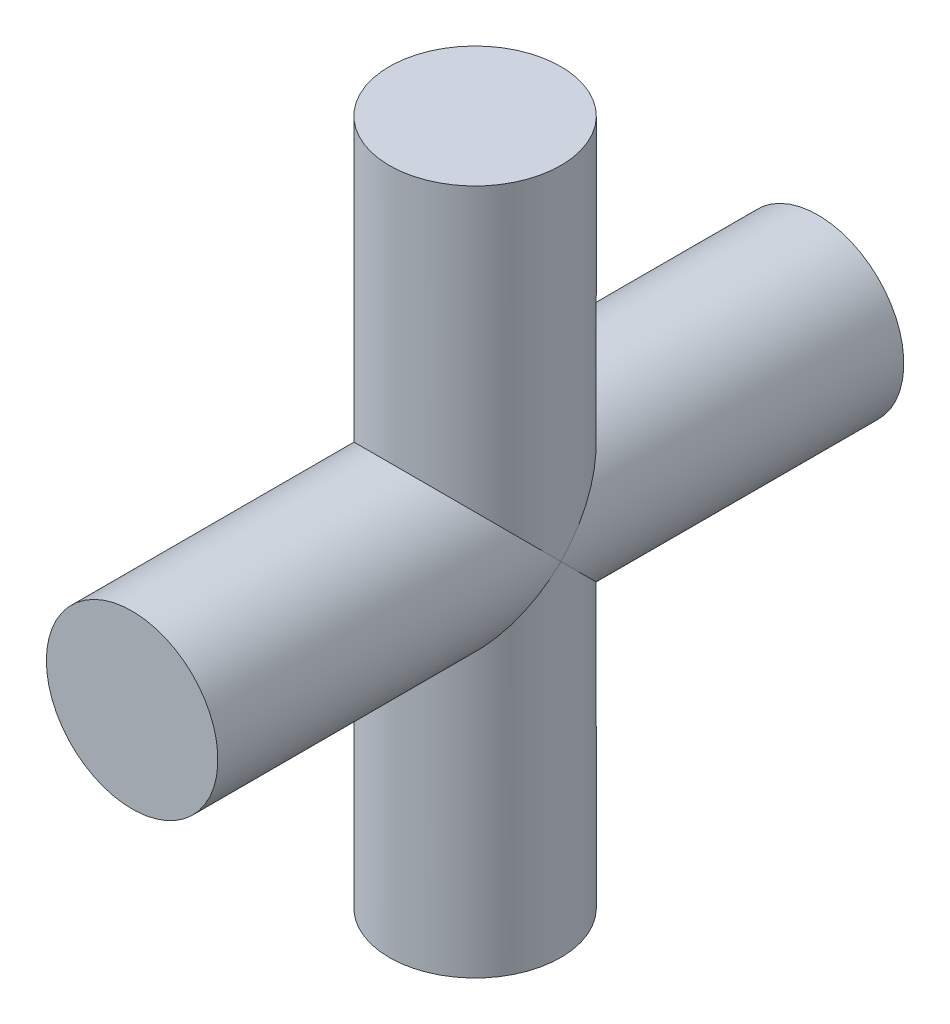
ISO-10303-21;
HEADER;
FILE_DESCRIPTION(('STEP AP214'),'2;1');
FILE_NAME('part.step','',(''),(''),'','','');
FILE_SCHEMA(('AUTOMOTIVE_DESIGN { 1 0 10303 214 1 1 1 1 }'));
ENDSEC;
DATA;
#1=APPLICATION_CONTEXT('core data for automotive mechanical design processes');
#2=APPLICATION_PROTOCOL_DEFINITION('international standard','automotive_design',2000,#1);
#3=PRODUCT_CONTEXT('',#1,'mechanical');
#4=PRODUCT('Part','Part','',(#3));
#5=PRODUCT_RELATED_PRODUCT_CATEGORY('part','',(#4));
#6=PRODUCT_DEFINITION_FORMATION('','',#4);
#7=PRODUCT_DEFINITION_CONTEXT('part definition',#1,'design');
#8=PRODUCT_DEFINITION('design','',#6,#7);
#9=PRODUCT_DEFINITION_SHAPE('','',#8);
#10=(LENGTH_UNIT() NAMED_UNIT(*) SI_UNIT(.MILLI.,.METRE.));
#11=(NAMED_UNIT(*) PLANE_ANGLE_UNIT() SI_UNIT($,.RADIAN.));
#12=(NAMED_UNIT(*) SI_UNIT($,.STERADIAN.) SOLID_ANGLE_UNIT());
#13=UNCERTAINTY_MEASURE_WITH_UNIT(LENGTH_MEASURE(1.E-05),#10,'distance_accuracy_value','');
#14=(GEOMETRIC_REPRESENTATION_CONTEXT(3) GLOBAL_UNCERTAINTY_ASSIGNED_CONTEXT((#13)) GLOBAL_UNIT_ASSIGNED_CONTEXT((#10,
#11,#12)) REPRESENTATION_CONTEXT('',''));
#15=CARTESIAN_POINT('',(0.,0.,0.));
#16=DIRECTION('',(0.,0.,1.));
#17=DIRECTION('',(1.,0.,0.));
#18=AXIS2_PLACEMENT_3D('',#15,#16,#17);
#19=CARTESIAN_POINT('',(2.,-16.,0.));
#20=DIRECTION('',(0.,-1.,0.));
#21=DIRECTION('',(0.,0.,-1.));
#22=AXIS2_PLACEMENT_3D('',#19,#20,#21);
#23=PLANE('',#22);
#24=CARTESIAN_POINT('',(0.,-16.,0.));
#25=DIRECTION('',(0.,1.,0.));
#26=DIRECTION('',(0.,0.,1.));
#27=AXIS2_PLACEMENT_3D('',#24,#25,#26);
#28=CIRCLE('',#27,4.);
#29=CARTESIAN_POINT('',(0.,-16.,4.));
#30=VERTEX_POINT('',#29);
#31=EDGE_CURVE('E21',#30,#30,#28,.T.);
#32=ORIENTED_EDGE('',*,*,#31,.F.);
#33=EDGE_LOOP('',(#32));
#34=FACE_BOUND('',#33,.T.);
#35=ADVANCED_FACE('F18',(#34),#23,.T.);
#36=CARTESIAN_POINT('',(0.,0.,0.));
#37=DIRECTION('',(0.,1.,0.));
#38=DIRECTION('',(0.,0.,1.));
#39=AXIS2_PLACEMENT_3D('',#36,#37,#38);
#40=CYLINDRICAL_SURFACE('',#39,4.);
#41=ORIENTED_EDGE('',*,*,#31,.T.);
#42=EDGE_LOOP('',(#41));
#43=FACE_BOUND('',#42,.T.);
#44=CARTESIAN_POINT('',(0.,0.,0.));
#45=DIRECTION('',(0.,0.707106781186547,-0.707106781186547));
#46=DIRECTION('',(0.,0.707106781186547,0.707106781186547));
#47=AXIS2_PLACEMENT_3D('',#44,#45,#46);
#48=ELLIPSE('',#47,5.65685424949238,4.);
#49=CARTESIAN_POINT('',(4.,0.,0.));
#50=VERTEX_POINT('',#49);
#51=CARTESIAN_POINT('',(-4.,0.,0.));
#52=VERTEX_POINT('',#51);
#53=EDGE_CURVE('E35',#50,#52,#48,.T.);
#54=ORIENTED_EDGE('',*,*,#53,.F.);
#55=CARTESIAN_POINT('',(0.,0.,0.));
#56=DIRECTION('',(0.,-0.707106781186547,-0.707106781186547));
#57=DIRECTION('',(0.,0.707106781186547,-0.707106781186547));
#58=AXIS2_PLACEMENT_3D('',#55,#56,#57);
#59=ELLIPSE('',#58,5.65685424949238,4.);
#60=EDGE_CURVE('E33',#52,#50,#59,.F.);
#61=ORIENTED_EDGE('',*,*,#60,.F.);
#62=EDGE_LOOP('',(#54,#61));
#63=FACE_BOUND('',#62,.T.);
#64=ADVANCED_FACE('F36',(#43,#63),#40,.T.);
#65=CARTESIAN_POINT('',(2.,0.,16.));
#66=DIRECTION('',(0.,0.,1.));
#67=DIRECTION('',(1.,0.,0.));
#68=AXIS2_PLACEMENT_3D('',#65,#66,#67);
#69=PLANE('',#68);
#70=CARTESIAN_POINT('',(0.,0.,16.));
#71=DIRECTION('',(0.,0.,-1.));
#72=DIRECTION('',(-1.,0.,0.));
#73=AXIS2_PLACEMENT_3D('',#70,#71,#72);
#74=CIRCLE('',#73,4.);
#75=CARTESIAN_POINT('',(-4.,0.,16.));
#76=VERTEX_POINT('',#75);
#77=EDGE_CURVE('E40',#76,#76,#74,.T.);
#78=ORIENTED_EDGE('',*,*,#77,.F.);
#79=EDGE_LOOP('',(#78));
#80=FACE_BOUND('',#79,.T.);
#81=ADVANCED_FACE('F61',(#80),#69,.T.);
#82=CARTESIAN_POINT('',(2.,0.,-16.));
#83=DIRECTION('',(0.,0.,-1.));
#84=DIRECTION('',(-1.,0.,0.));
#85=AXIS2_PLACEMENT_3D('',#82,#83,#84);
#86=PLANE('',#85);
#87=CARTESIAN_POINT('',(0.,0.,-16.));
#88=DIRECTION('',(0.,0.,-1.));
#89=DIRECTION('',(-1.,0.,0.));
#90=AXIS2_PLACEMENT_3D('',#87,#88,#89);
#91=CIRCLE('',#90,4.);
#92=CARTESIAN_POINT('',(-4.,0.,-16.));
#93=VERTEX_POINT('',#92);
#94=EDGE_CURVE('E51',#93,#93,#91,.F.);
#95=ORIENTED_EDGE('',*,*,#94,.F.);
#96=EDGE_LOOP('',(#95));
#97=FACE_BOUND('',#96,.T.);
#98=ADVANCED_FACE('F63',(#97),#86,.T.);
#99=CARTESIAN_POINT('',(0.,0.,0.));
#100=DIRECTION('',(0.,0.,-1.));
#101=DIRECTION('',(-1.,0.,0.));
#102=AXIS2_PLACEMENT_3D('',#99,#100,#101);
#103=CYLINDRICAL_SURFACE('',#102,4.);
#104=ORIENTED_EDGE('',*,*,#60,.T.);
#105=CARTESIAN_POINT('',(0.,0.,0.));
#106=DIRECTION('',(0.,0.707106781186547,-0.707106781186547));
#107=DIRECTION('',(0.,-0.707106781186547,-0.707106781186547));
#108=AXIS2_PLACEMENT_3D('',#105,#106,#107);
#109=ELLIPSE('',#108,5.65685424949238,4.);
#110=EDGE_CURVE('E46',#52,#50,#109,.T.);
#111=ORIENTED_EDGE('',*,*,#110,.F.);
#112=EDGE_LOOP('',(#104,#111));
#113=FACE_BOUND('',#112,.T.);
#114=ORIENTED_EDGE('',*,*,#77,.T.);
#115=EDGE_LOOP('',(#114));
#116=FACE_BOUND('',#115,.T.);
#117=ADVANCED_FACE('F44',(#113,#116),#103,.T.);
#118=CARTESIAN_POINT('',(0.,0.,0.));
#119=DIRECTION('',(0.,0.,-1.));
#120=DIRECTION('',(-1.,0.,0.));
#121=AXIS2_PLACEMENT_3D('',#118,#119,#120);
#122=CYLINDRICAL_SURFACE('',#121,4.);
#123=ORIENTED_EDGE('',*,*,#94,.T.);
#124=EDGE_LOOP('',(#123));
#125=FACE_BOUND('',#124,.T.);
#126=CARTESIAN_POINT('',(0.,0.,0.));
#127=DIRECTION('',(0.,0.707106781186547,0.707106781186547));
#128=DIRECTION('',(0.,0.707106781186547,-0.707106781186547));
#129=AXIS2_PLACEMENT_3D('',#126,#127,#128);
#130=ELLIPSE('',#129,5.65685424949238,4.);
#131=EDGE_CURVE('E27',#50,#52,#130,.T.);
#132=ORIENTED_EDGE('',*,*,#131,.F.);
#133=ORIENTED_EDGE('',*,*,#53,.T.);
#134=EDGE_LOOP('',(#132,#133));
#135=FACE_BOUND('',#134,.T.);
#136=ADVANCED_FACE('F53',(#125,#135),#122,.T.);
#137=CARTESIAN_POINT('',(2.,16.,0.));
#138=DIRECTION('',(0.,1.,0.));
#139=DIRECTION('',(0.,0.,1.));
#140=AXIS2_PLACEMENT_3D('',#137,#138,#139);
#141=PLANE('',#140);
#142=CARTESIAN_POINT('',(0.,16.,0.));
#143=DIRECTION('',(0.,1.,0.));
#144=DIRECTION('',(0.,0.,1.));
#145=AXIS2_PLACEMENT_3D('',#142,#143,#144);
#146=CIRCLE('',#145,4.);
#147=CARTESIAN_POINT('',(0.,16.,4.));
#148=VERTEX_POINT('',#147);
#149=EDGE_CURVE('E11',#148,#148,#146,.F.);
#150=ORIENTED_EDGE('',*,*,#149,.F.);
#151=EDGE_LOOP('',(#150));
#152=FACE_BOUND('',#151,.T.);
#153=ADVANCED_FACE('F74',(#152),#141,.T.);
#154=CARTESIAN_POINT('',(0.,0.,0.));
#155=DIRECTION('',(0.,1.,0.));
#156=DIRECTION('',(0.,0.,1.));
#157=AXIS2_PLACEMENT_3D('',#154,#155,#156);
#158=CYLINDRICAL_SURFACE('',#157,4.);
#159=ORIENTED_EDGE('',*,*,#110,.T.);
#160=ORIENTED_EDGE('',*,*,#131,.T.);
#161=EDGE_LOOP('',(#159,#160));
#162=FACE_BOUND('',#161,.T.);
#163=ORIENTED_EDGE('',*,*,#149,.T.);
#164=EDGE_LOOP('',(#163));
#165=FACE_BOUND('',#164,.T.);
#166=ADVANCED_FACE('F49',(#162,#165),#158,.T.);
#167=CLOSED_SHELL('',(#35,#64,#81,#98,#117,#136,#153,#166));
#168=MANIFOLD_SOLID_BREP('B1',#167);
#169=ADVANCED_BREP_SHAPE_REPRESENTATION('',(#18,#168),#14);
#170=SHAPE_DEFINITION_REPRESENTATION(#9,#169);
ENDSEC;
END-ISO-10303-21;
